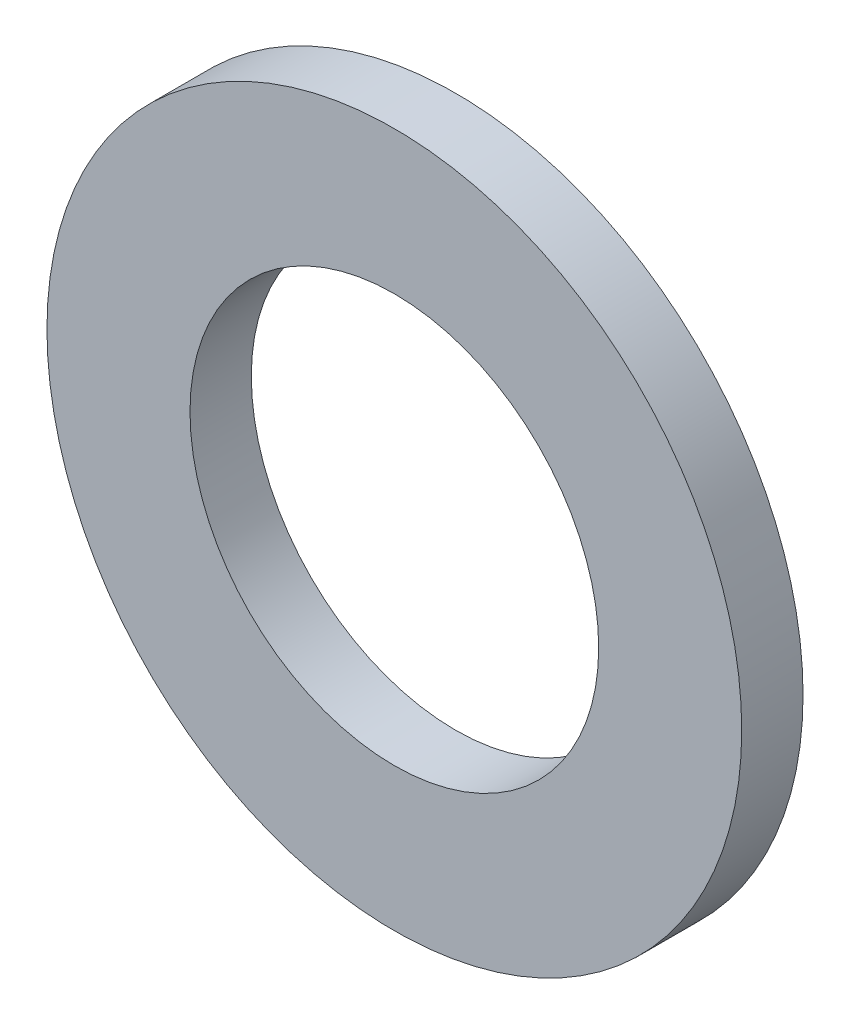
ISO-10303-21;
HEADER;
FILE_DESCRIPTION(('STEP AP214'),'2;1');
FILE_NAME('part.step','',(''),(''),'','','');
FILE_SCHEMA(('AUTOMOTIVE_DESIGN { 1 0 10303 214 1 1 1 1 }'));
ENDSEC;
DATA;
#1=APPLICATION_CONTEXT('core data for automotive mechanical design processes');
#2=APPLICATION_PROTOCOL_DEFINITION('international standard','automotive_design',2000,#1);
#3=PRODUCT_CONTEXT('',#1,'mechanical');
#4=PRODUCT('Part','Part','',(#3));
#5=PRODUCT_RELATED_PRODUCT_CATEGORY('part','',(#4));
#6=PRODUCT_DEFINITION_FORMATION('','',#4);
#7=PRODUCT_DEFINITION_CONTEXT('part definition',#1,'design');
#8=PRODUCT_DEFINITION('design','',#6,#7);
#9=PRODUCT_DEFINITION_SHAPE('','',#8);
#10=(LENGTH_UNIT() NAMED_UNIT(*) SI_UNIT(.MILLI.,.METRE.));
#11=(NAMED_UNIT(*) PLANE_ANGLE_UNIT() SI_UNIT($,.RADIAN.));
#12=(NAMED_UNIT(*) SI_UNIT($,.STERADIAN.) SOLID_ANGLE_UNIT());
#13=UNCERTAINTY_MEASURE_WITH_UNIT(LENGTH_MEASURE(1.E-05),#10,'distance_accuracy_value','');
#14=(GEOMETRIC_REPRESENTATION_CONTEXT(3) GLOBAL_UNCERTAINTY_ASSIGNED_CONTEXT((#13)) GLOBAL_UNIT_ASSIGNED_CONTEXT((#10,
#11,#12)) REPRESENTATION_CONTEXT('',''));
#15=CARTESIAN_POINT('',(0.,0.,0.));
#16=DIRECTION('',(0.,0.,1.));
#17=DIRECTION('',(1.,0.,0.));
#18=AXIS2_PLACEMENT_3D('',#15,#16,#17);
#19=CARTESIAN_POINT('',(0.,0.,1.5));
#20=DIRECTION('',(0.,0.,1.));
#21=DIRECTION('',(1.,0.,0.));
#22=AXIS2_PLACEMENT_3D('',#19,#20,#21);
#23=PLANE('',#22);
#24=CARTESIAN_POINT('',(0.,0.,1.5));
#25=DIRECTION('',(0.,0.,1.));
#26=DIRECTION('',(1.,0.,0.));
#27=AXIS2_PLACEMENT_3D('',#24,#25,#26);
#28=CIRCLE('',#27,8.5);
#29=CARTESIAN_POINT('',(8.5,0.,1.5));
#30=VERTEX_POINT('',#29);
#31=EDGE_CURVE('E10',#30,#30,#28,.T.);
#32=ORIENTED_EDGE('',*,*,#31,.T.);
#33=EDGE_LOOP('',(#32));
#34=FACE_BOUND('',#33,.T.);
#35=CARTESIAN_POINT('',(0.,0.,1.5));
#36=DIRECTION('',(0.,0.,1.));
#37=DIRECTION('',(1.,0.,0.));
#38=AXIS2_PLACEMENT_3D('',#35,#36,#37);
#39=CIRCLE('',#38,5.);
#40=CARTESIAN_POINT('',(5.,0.,1.5));
#41=VERTEX_POINT('',#40);
#42=EDGE_CURVE('E43',#41,#41,#39,.T.);
#43=ORIENTED_EDGE('',*,*,#42,.F.);
#44=EDGE_LOOP('',(#43));
#45=FACE_BOUND('',#44,.T.);
#46=ADVANCED_FACE('F32',(#34,#45),#23,.T.);
#47=CARTESIAN_POINT('',(0.,0.,0.));
#48=DIRECTION('',(0.,0.,1.));
#49=DIRECTION('',(1.,0.,0.));
#50=AXIS2_PLACEMENT_3D('',#47,#48,#49);
#51=PLANE('',#50);
#52=CARTESIAN_POINT('',(0.,0.,0.));
#53=DIRECTION('',(0.,0.,1.));
#54=DIRECTION('',(1.,0.,0.));
#55=AXIS2_PLACEMENT_3D('',#52,#53,#54);
#56=CIRCLE('',#55,8.5);
#57=CARTESIAN_POINT('',(8.5,0.,0.));
#58=VERTEX_POINT('',#57);
#59=EDGE_CURVE('E36',#58,#58,#56,.T.);
#60=ORIENTED_EDGE('',*,*,#59,.F.);
#61=EDGE_LOOP('',(#60));
#62=FACE_BOUND('',#61,.T.);
#63=CARTESIAN_POINT('',(0.,0.,0.));
#64=DIRECTION('',(0.,0.,1.));
#65=DIRECTION('',(1.,0.,0.));
#66=AXIS2_PLACEMENT_3D('',#63,#64,#65);
#67=CIRCLE('',#66,5.);
#68=CARTESIAN_POINT('',(5.,0.,0.));
#69=VERTEX_POINT('',#68);
#70=EDGE_CURVE('E45',#69,#69,#67,.T.);
#71=ORIENTED_EDGE('',*,*,#70,.T.);
#72=EDGE_LOOP('',(#71));
#73=FACE_BOUND('',#72,.T.);
#74=ADVANCED_FACE('F55',(#62,#73),#51,.F.);
#75=CARTESIAN_POINT('',(0.,0.,1.5));
#76=DIRECTION('',(0.,0.,-1.));
#77=DIRECTION('',(-1.,0.,0.));
#78=AXIS2_PLACEMENT_3D('',#75,#76,#77);
#79=CYLINDRICAL_SURFACE('',#78,8.5);
#80=ORIENTED_EDGE('',*,*,#31,.F.);
#81=EDGE_LOOP('',(#80));
#82=FACE_BOUND('',#81,.T.);
#83=ORIENTED_EDGE('',*,*,#59,.T.);
#84=EDGE_LOOP('',(#83));
#85=FACE_BOUND('',#84,.T.);
#86=ADVANCED_FACE('F34',(#82,#85),#79,.T.);
#87=CARTESIAN_POINT('',(0.,0.,1.5));
#88=DIRECTION('',(0.,0.,-1.));
#89=DIRECTION('',(-1.,0.,0.));
#90=AXIS2_PLACEMENT_3D('',#87,#88,#89);
#91=CYLINDRICAL_SURFACE('',#90,5.);
#92=ORIENTED_EDGE('',*,*,#42,.T.);
#93=EDGE_LOOP('',(#92));
#94=FACE_BOUND('',#93,.T.);
#95=ORIENTED_EDGE('',*,*,#70,.F.);
#96=EDGE_LOOP('',(#95));
#97=FACE_BOUND('',#96,.T.);
#98=ADVANCED_FACE('F51',(#94,#97),#91,.F.);
#99=CLOSED_SHELL('',(#46,#74,#86,#98));
#100=MANIFOLD_SOLID_BREP('B2',#99);
#101=ADVANCED_BREP_SHAPE_REPRESENTATION('',(#18,#100),#14);
#102=SHAPE_DEFINITION_REPRESENTATION(#9,#101);
ENDSEC;
END-ISO-10303-21;
